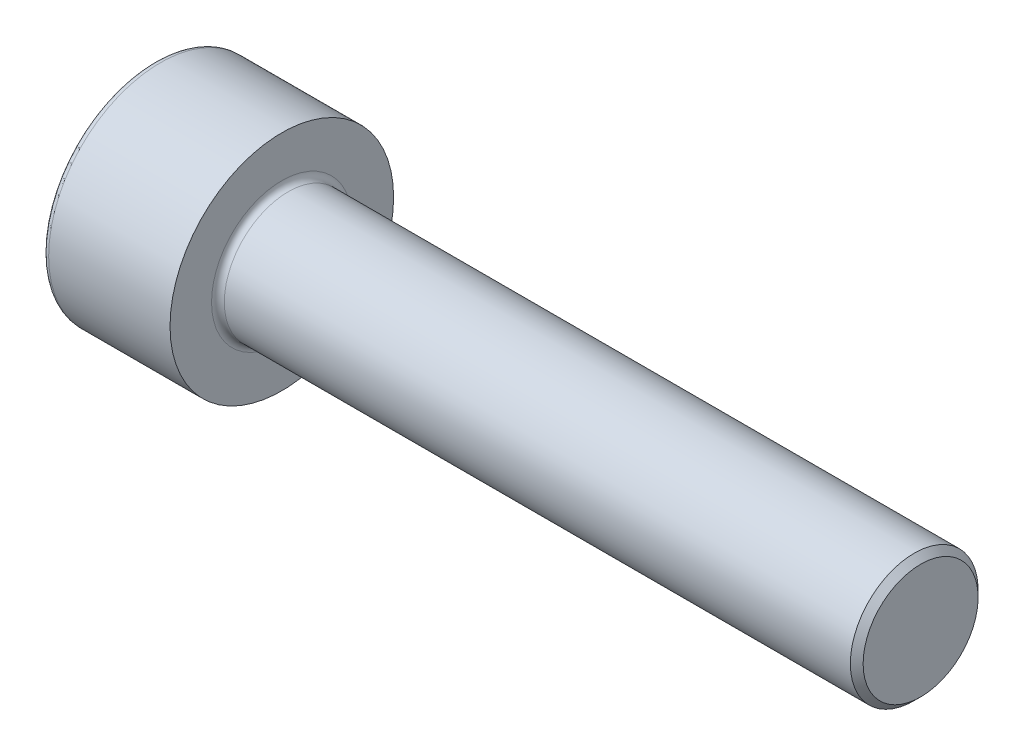
ISO-10303-21;
HEADER;
FILE_DESCRIPTION(('STEP AP214'),'2;1');
FILE_NAME('part.step','',(''),(''),'','','');
FILE_SCHEMA(('AUTOMOTIVE_DESIGN { 1 0 10303 214 1 1 1 1 }'));
ENDSEC;
DATA;
#1=APPLICATION_CONTEXT('core data for automotive mechanical design processes');
#2=APPLICATION_PROTOCOL_DEFINITION('international standard','automotive_design',2000,#1);
#3=PRODUCT_CONTEXT('',#1,'mechanical');
#4=PRODUCT('Part','Part','',(#3));
#5=PRODUCT_RELATED_PRODUCT_CATEGORY('part','',(#4));
#6=PRODUCT_DEFINITION_FORMATION('','',#4);
#7=PRODUCT_DEFINITION_CONTEXT('part definition',#1,'design');
#8=PRODUCT_DEFINITION('design','',#6,#7);
#9=PRODUCT_DEFINITION_SHAPE('','',#8);
#10=(LENGTH_UNIT() NAMED_UNIT(*) SI_UNIT(.MILLI.,.METRE.));
#11=(NAMED_UNIT(*) PLANE_ANGLE_UNIT() SI_UNIT($,.RADIAN.));
#12=(NAMED_UNIT(*) SI_UNIT($,.STERADIAN.) SOLID_ANGLE_UNIT());
#13=UNCERTAINTY_MEASURE_WITH_UNIT(LENGTH_MEASURE(1.E-05),#10,'distance_accuracy_value','');
#14=(GEOMETRIC_REPRESENTATION_CONTEXT(3) GLOBAL_UNCERTAINTY_ASSIGNED_CONTEXT((#13)) GLOBAL_UNIT_ASSIGNED_CONTEXT((#10,
#11,#12)) REPRESENTATION_CONTEXT('',''));
#15=CARTESIAN_POINT('',(0.,0.,0.));
#16=DIRECTION('',(0.,0.,1.));
#17=DIRECTION('',(1.,0.,0.));
#18=AXIS2_PLACEMENT_3D('',#15,#16,#17);
#19=CARTESIAN_POINT('',(0.,0.,0.));
#20=DIRECTION('',(1.,0.,0.));
#21=DIRECTION('',(0.,0.,-0.999999999999998));
#22=AXIS2_PLACEMENT_3D('',#19,#20,#21);
#23=PLANE('',#22);
#24=CARTESIAN_POINT('',(0.,0.,0.));
#25=DIRECTION('',(1.,0.,0.));
#26=DIRECTION('',(0.,0.,-0.999999999999998));
#27=AXIS2_PLACEMENT_3D('',#24,#25,#26);
#28=CIRCLE('',#27,3.3);
#29=CARTESIAN_POINT('',(0.,0.,-3.29999999999999));
#30=VERTEX_POINT('',#29);
#31=EDGE_CURVE('E169',#30,#30,#28,.F.);
#32=ORIENTED_EDGE('',*,*,#31,.T.);
#33=EDGE_LOOP('',(#32));
#34=FACE_BOUND('',#33,.T.);
#35=DIRECTION('',(0.,0.,-0.999999999999998));
#36=VECTOR('',#35,1.);
#37=CARTESIAN_POINT('',(0.,1.50000000000039,0.866025403784887));
#38=LINE('',#37,#36);
#39=CARTESIAN_POINT('',(0.,1.50000000000039,0.866025403784887));
#40=VERTEX_POINT('',#39);
#41=CARTESIAN_POINT('',(0.,1.50000000000061,-0.86602540378411));
#42=VERTEX_POINT('',#41);
#43=EDGE_CURVE('E64',#40,#42,#38,.T.);
#44=ORIENTED_EDGE('',*,*,#43,.F.);
#45=DIRECTION('',(0.,0.866025403784441,-0.500000000000002));
#46=VECTOR('',#45,1.);
#47=CARTESIAN_POINT('',(0.,6.66133814775094E-13,1.73205080756889));
#48=LINE('',#47,#46);
#49=CARTESIAN_POINT('',(0.,6.66133814775094E-13,1.73205080756889));
#50=VERTEX_POINT('',#49);
#51=EDGE_CURVE('E138',#50,#40,#48,.T.);
#52=ORIENTED_EDGE('',*,*,#51,.F.);
#53=DIRECTION('',(0.,0.866025403784438,0.499999999999996));
#54=VECTOR('',#53,1.);
#55=CARTESIAN_POINT('',(0.,-1.50000000000039,0.866025403784942));
#56=LINE('',#55,#54);
#57=CARTESIAN_POINT('',(0.,-1.50000000000039,0.866025403784942));
#58=VERTEX_POINT('',#57);
#59=EDGE_CURVE('E148',#58,#50,#56,.T.);
#60=ORIENTED_EDGE('',*,*,#59,.F.);
#61=DIRECTION('',(0.,0.,0.999999999999998));
#62=VECTOR('',#61,1.);
#63=CARTESIAN_POINT('',(0.,-1.50000000000083,-0.866025403784609));
#64=LINE('',#63,#62);
#65=CARTESIAN_POINT('',(0.,-1.50000000000083,-0.866025403784609));
#66=VERTEX_POINT('',#65);
#67=EDGE_CURVE('E297',#66,#58,#64,.T.);
#68=ORIENTED_EDGE('',*,*,#67,.F.);
#69=DIRECTION('',(0.,-0.866025403784441,0.500000000000002));
#70=VECTOR('',#69,1.);
#71=CARTESIAN_POINT('',(0.,-5.55111512312578E-13,-1.73205080756911));
#72=LINE('',#71,#70);
#73=CARTESIAN_POINT('',(0.,-5.55111512312578E-13,-1.73205080756911));
#74=VERTEX_POINT('',#73);
#75=EDGE_CURVE('E124',#74,#66,#72,.T.);
#76=ORIENTED_EDGE('',*,*,#75,.F.);
#77=DIRECTION('',(0.,-0.866025403784438,-0.499999999999996));
#78=VECTOR('',#77,1.);
#79=CARTESIAN_POINT('',(0.,1.50000000000061,-0.86602540378411));
#80=LINE('',#79,#78);
#81=EDGE_CURVE('E122',#42,#74,#80,.T.);
#82=ORIENTED_EDGE('',*,*,#81,.F.);
#83=EDGE_LOOP('',(#44,#52,#60,#68,#76,#82));
#84=FACE_BOUND('',#83,.T.);
#85=ADVANCED_FACE('F49',(#34,#84),#23,.F.);
#86=CARTESIAN_POINT('',(0.,0.,0.));
#87=DIRECTION('',(-1.,0.,0.));
#88=DIRECTION('',(0.,0.,0.999999999999998));
#89=AXIS2_PLACEMENT_3D('',#86,#87,#88);
#90=CYLINDRICAL_SURFACE('',#89,3.5);
#91=CARTESIAN_POINT('',(0.200000000000006,0.,0.));
#92=DIRECTION('',(1.,0.,0.));
#93=DIRECTION('',(0.,0.,-0.999999999999998));
#94=AXIS2_PLACEMENT_3D('',#91,#92,#93);
#95=CIRCLE('',#94,3.5);
#96=CARTESIAN_POINT('',(0.200000000000009,0.,-3.49999999999999));
#97=VERTEX_POINT('',#96);
#98=EDGE_CURVE('E172',#97,#97,#95,.T.);
#99=ORIENTED_EDGE('',*,*,#98,.T.);
#100=EDGE_LOOP('',(#99));
#101=FACE_BOUND('',#100,.T.);
#102=CARTESIAN_POINT('',(4.,0.,0.));
#103=DIRECTION('',(-1.,0.,0.));
#104=DIRECTION('',(0.,0.,0.999999999999998));
#105=AXIS2_PLACEMENT_3D('',#102,#103,#104);
#106=CIRCLE('',#105,3.5);
#107=CARTESIAN_POINT('',(4.,0.,3.49999999999999));
#108=VERTEX_POINT('',#107);
#109=EDGE_CURVE('E159',#108,#108,#106,.T.);
#110=ORIENTED_EDGE('',*,*,#109,.T.);
#111=EDGE_LOOP('',(#110));
#112=FACE_BOUND('',#111,.T.);
#113=ADVANCED_FACE('F190',(#101,#112),#90,.T.);
#114=CARTESIAN_POINT('',(4.,3.50000000000095,1.11022302462516E-13));
#115=DIRECTION('',(-1.,0.,0.));
#116=DIRECTION('',(0.,0.,0.999999999999998));
#117=AXIS2_PLACEMENT_3D('',#114,#115,#116);
#118=PLANE('',#117);
#119=CARTESIAN_POINT('',(4.,0.,0.));
#120=DIRECTION('',(-1.,0.,0.));
#121=DIRECTION('',(0.,0.,0.999999999999998));
#122=AXIS2_PLACEMENT_3D('',#119,#120,#121);
#123=CIRCLE('',#122,2.2);
#124=CARTESIAN_POINT('',(4.,0.,2.2));
#125=VERTEX_POINT('',#124);
#126=EDGE_CURVE('E163',#125,#125,#123,.T.);
#127=ORIENTED_EDGE('',*,*,#126,.T.);
#128=EDGE_LOOP('',(#127));
#129=FACE_BOUND('',#128,.T.);
#130=ORIENTED_EDGE('',*,*,#109,.F.);
#131=EDGE_LOOP('',(#130));
#132=FACE_BOUND('',#131,.T.);
#133=ADVANCED_FACE('F196',(#129,#132),#118,.F.);
#134=CARTESIAN_POINT('',(0.,0.,0.));
#135=DIRECTION('',(-1.,0.,0.));
#136=DIRECTION('',(0.,0.,0.999999999999998));
#137=AXIS2_PLACEMENT_3D('',#134,#135,#136);
#138=CYLINDRICAL_SURFACE('',#137,2.);
#139=CARTESIAN_POINT('',(23.8,0.,0.));
#140=DIRECTION('',(-1.,0.,0.));
#141=DIRECTION('',(0.,0.,0.999999999999998));
#142=AXIS2_PLACEMENT_3D('',#139,#140,#141);
#143=CIRCLE('',#142,2.);
#144=CARTESIAN_POINT('',(23.8,0.,2.));
#145=VERTEX_POINT('',#144);
#146=EDGE_CURVE('E57',#145,#145,#143,.T.);
#147=ORIENTED_EDGE('',*,*,#146,.T.);
#148=EDGE_LOOP('',(#147));
#149=FACE_BOUND('',#148,.T.);
#150=CARTESIAN_POINT('',(4.20000000000001,0.,0.));
#151=DIRECTION('',(-1.,0.,0.));
#152=DIRECTION('',(0.,0.,0.999999999999998));
#153=AXIS2_PLACEMENT_3D('',#150,#151,#152);
#154=CIRCLE('',#153,2.);
#155=CARTESIAN_POINT('',(4.20000000000001,0.,2.));
#156=VERTEX_POINT('',#155);
#157=EDGE_CURVE('E166',#156,#156,#154,.F.);
#158=ORIENTED_EDGE('',*,*,#157,.T.);
#159=EDGE_LOOP('',(#158));
#160=FACE_BOUND('',#159,.T.);
#161=ADVANCED_FACE('F177',(#149,#160),#138,.T.);
#162=CARTESIAN_POINT('',(24.,2.00000000000022,0.));
#163=DIRECTION('',(-1.,0.,0.));
#164=DIRECTION('',(0.,0.,0.999999999999998));
#165=AXIS2_PLACEMENT_3D('',#162,#163,#164);
#166=PLANE('',#165);
#167=CARTESIAN_POINT('',(24.,0.,0.));
#168=DIRECTION('',(-1.,0.,0.));
#169=DIRECTION('',(0.,0.,0.999999999999998));
#170=AXIS2_PLACEMENT_3D('',#167,#168,#169);
#171=CIRCLE('',#170,1.79999999999999);
#172=CARTESIAN_POINT('',(24.,0.,1.79999999999999));
#173=VERTEX_POINT('',#172);
#174=EDGE_CURVE('E14',#173,#173,#171,.F.);
#175=ORIENTED_EDGE('',*,*,#174,.T.);
#176=EDGE_LOOP('',(#175));
#177=FACE_BOUND('',#176,.T.);
#178=ADVANCED_FACE('F221',(#177),#166,.F.);
#179=CARTESIAN_POINT('',(8.58257569495582,5.55111512312578E-13,1.73205080756933));
#180=DIRECTION('',(0.,0.499999999999997,0.866025403784436));
#181=DIRECTION('',(0.,-0.866025403784441,0.500000000000002));
#182=AXIS2_PLACEMENT_3D('',#179,#180,#181);
#183=PLANE('',#182);
#184=ORIENTED_EDGE('',*,*,#51,.T.);
#185=DIRECTION('',(-1.,0.,0.));
#186=VECTOR('',#185,1.);
#187=CARTESIAN_POINT('',(8.58257569495582,1.50000000000072,0.866025403784942));
#188=LINE('',#187,#186);
#189=CARTESIAN_POINT('',(2.59999999999999,1.50000000000039,0.866025403784887));
#190=VERTEX_POINT('',#189);
#191=EDGE_CURVE('E136',#190,#40,#188,.T.);
#192=ORIENTED_EDGE('',*,*,#191,.F.);
#193=DIRECTION('',(0.,-0.866025403784441,0.500000000000002));
#194=VECTOR('',#193,1.);
#195=CARTESIAN_POINT('',(2.59999999999999,6.66133814775094E-13,1.73205080756889));
#196=LINE('',#195,#194);
#197=CARTESIAN_POINT('',(2.59999999999999,0.750000000000806,1.29903810567694));
#198=VERTEX_POINT('',#197);
#199=EDGE_CURVE('E72',#190,#198,#196,.T.);
#200=ORIENTED_EDGE('',*,*,#199,.T.);
#201=CARTESIAN_POINT('',(2.59999999999999,6.66133814775094E-13,1.73205080756889));
#202=VERTEX_POINT('',#201);
#203=EDGE_CURVE('E269',#198,#202,#196,.T.);
#204=ORIENTED_EDGE('',*,*,#203,.T.);
#205=DIRECTION('',(-1.,0.,0.));
#206=VECTOR('',#205,1.);
#207=CARTESIAN_POINT('',(8.58257569495582,5.55111512312578E-13,1.73205080756933));
#208=LINE('',#207,#206);
#209=EDGE_CURVE('E284',#202,#50,#208,.T.);
#210=ORIENTED_EDGE('',*,*,#209,.T.);
#211=EDGE_LOOP('',(#184,#192,#200,#204,#210));
#212=FACE_BOUND('',#211,.T.);
#213=ADVANCED_FACE('F225',(#212),#183,.F.);
#214=CARTESIAN_POINT('',(8.58257569495582,-1.50000000000061,0.866025403784998));
#215=DIRECTION('',(0.,-0.500000000000004,0.866025403784439));
#216=DIRECTION('',(0.,-0.866025403784439,-0.499999999999996));
#217=AXIS2_PLACEMENT_3D('',#214,#215,#216);
#218=PLANE('',#217);
#219=ORIENTED_EDGE('',*,*,#59,.T.);
#220=ORIENTED_EDGE('',*,*,#209,.F.);
#221=DIRECTION('',(0.,-0.866025403784439,-0.499999999999996));
#222=VECTOR('',#221,1.);
#223=CARTESIAN_POINT('',(2.60000000000002,-1.50000000000039,0.866025403784942));
#224=LINE('',#223,#222);
#225=CARTESIAN_POINT('',(2.60000000000002,-0.750000000000361,1.29903810567644));
#226=VERTEX_POINT('',#225);
#227=EDGE_CURVE('E267',#202,#226,#224,.T.);
#228=ORIENTED_EDGE('',*,*,#227,.T.);
#229=CARTESIAN_POINT('',(2.60000000000002,-1.50000000000039,0.866025403784942));
#230=VERTEX_POINT('',#229);
#231=EDGE_CURVE('E275',#226,#230,#224,.T.);
#232=ORIENTED_EDGE('',*,*,#231,.T.);
#233=DIRECTION('',(-1.,0.,0.));
#234=VECTOR('',#233,1.);
#235=CARTESIAN_POINT('',(8.58257569495582,-1.50000000000061,0.866025403784998));
#236=LINE('',#235,#234);
#237=EDGE_CURVE('E301',#230,#58,#236,.T.);
#238=ORIENTED_EDGE('',*,*,#237,.T.);
#239=EDGE_LOOP('',(#219,#220,#228,#232,#238));
#240=FACE_BOUND('',#239,.T.);
#241=ADVANCED_FACE('F230',(#240),#218,.F.);
#242=CARTESIAN_POINT('',(8.58257569495571,-1.50000000000061,-0.866025403784332));
#243=DIRECTION('',(0.,-1.,0.));
#244=DIRECTION('',(0.,0.,-0.999999999999998));
#245=AXIS2_PLACEMENT_3D('',#242,#243,#244);
#246=PLANE('',#245);
#247=ORIENTED_EDGE('',*,*,#67,.T.);
#248=ORIENTED_EDGE('',*,*,#237,.F.);
#249=DIRECTION('',(0.,0.,-0.999999999999998));
#250=VECTOR('',#249,1.);
#251=CARTESIAN_POINT('',(2.60000000000002,-1.50000000000061,-0.866025403784332));
#252=LINE('',#251,#250);
#253=CARTESIAN_POINT('',(2.60000000000002,-1.50000000000006,0.));
#254=VERTEX_POINT('',#253);
#255=EDGE_CURVE('E278',#230,#254,#252,.T.);
#256=ORIENTED_EDGE('',*,*,#255,.T.);
#257=CARTESIAN_POINT('',(2.60000000000002,-1.50000000000061,-0.866025403784332));
#258=VERTEX_POINT('',#257);
#259=EDGE_CURVE('E304',#254,#258,#252,.T.);
#260=ORIENTED_EDGE('',*,*,#259,.T.);
#261=DIRECTION('',(-1.,0.,0.));
#262=VECTOR('',#261,1.);
#263=CARTESIAN_POINT('',(8.58257569495571,-1.50000000000061,-0.866025403784332));
#264=LINE('',#263,#262);
#265=EDGE_CURVE('E146',#258,#66,#264,.T.);
#266=ORIENTED_EDGE('',*,*,#265,.T.);
#267=EDGE_LOOP('',(#247,#248,#256,#260,#266));
#268=FACE_BOUND('',#267,.T.);
#269=ADVANCED_FACE('F239',(#268),#246,.F.);
#270=CARTESIAN_POINT('',(8.58257569495582,-7.7715611723761E-13,-1.7320508075685));
#271=DIRECTION('',(0.,-0.499999999999997,-0.866025403784436));
#272=DIRECTION('',(0.,0.866025403784441,-0.500000000000002));
#273=AXIS2_PLACEMENT_3D('',#270,#271,#272);
#274=PLANE('',#273);
#275=ORIENTED_EDGE('',*,*,#75,.T.);
#276=ORIENTED_EDGE('',*,*,#265,.F.);
#277=DIRECTION('',(0.,0.866025403784441,-0.500000000000002));
#278=VECTOR('',#277,1.);
#279=CARTESIAN_POINT('',(2.60000000000002,-5.55111512312578E-13,-1.732050807569));
#280=LINE('',#279,#278);
#281=CARTESIAN_POINT('',(2.59999999999999,-0.750000000000473,-1.29903810567633));
#282=VERTEX_POINT('',#281);
#283=EDGE_CURVE('E307',#258,#282,#280,.T.);
#284=ORIENTED_EDGE('',*,*,#283,.T.);
#285=CARTESIAN_POINT('',(2.60000000000002,-5.55111512312578E-13,-1.732050807569));
#286=VERTEX_POINT('',#285);
#287=EDGE_CURVE('E309',#282,#286,#280,.T.);
#288=ORIENTED_EDGE('',*,*,#287,.T.);
#289=DIRECTION('',(-1.,0.,0.));
#290=VECTOR('',#289,1.);
#291=CARTESIAN_POINT('',(8.58257569495582,-7.7715611723761E-13,-1.7320508075685));
#292=LINE('',#291,#290);
#293=EDGE_CURVE('E144',#286,#74,#292,.T.);
#294=ORIENTED_EDGE('',*,*,#293,.T.);
#295=EDGE_LOOP('',(#275,#276,#284,#288,#294));
#296=FACE_BOUND('',#295,.T.);
#297=ADVANCED_FACE('F236',(#296),#274,.F.);
#298=CARTESIAN_POINT('',(8.58257569495582,1.50000000000061,-0.86602540378411));
#299=DIRECTION('',(0.,0.500000000000004,-0.866025403784439));
#300=DIRECTION('',(0.,0.866025403784439,0.499999999999996));
#301=AXIS2_PLACEMENT_3D('',#298,#299,#300);
#302=PLANE('',#301);
#303=ORIENTED_EDGE('',*,*,#81,.T.);
#304=ORIENTED_EDGE('',*,*,#293,.F.);
#305=DIRECTION('',(0.,0.866025403784439,0.499999999999996));
#306=VECTOR('',#305,1.);
#307=CARTESIAN_POINT('',(2.59999999999999,1.50000000000061,-0.86602540378411));
#308=LINE('',#307,#306);
#309=CARTESIAN_POINT('',(2.60000000000002,0.749999999999362,-1.29903810567639));
#310=VERTEX_POINT('',#309);
#311=EDGE_CURVE('E311',#286,#310,#308,.T.);
#312=ORIENTED_EDGE('',*,*,#311,.T.);
#313=CARTESIAN_POINT('',(2.59999999999999,1.50000000000061,-0.86602540378411));
#314=VERTEX_POINT('',#313);
#315=EDGE_CURVE('E143',#310,#314,#308,.T.);
#316=ORIENTED_EDGE('',*,*,#315,.T.);
#317=DIRECTION('',(-1.,0.,0.));
#318=VECTOR('',#317,1.);
#319=CARTESIAN_POINT('',(8.58257569495582,1.50000000000061,-0.86602540378411));
#320=LINE('',#319,#318);
#321=EDGE_CURVE('E134',#314,#42,#320,.T.);
#322=ORIENTED_EDGE('',*,*,#321,.T.);
#323=EDGE_LOOP('',(#303,#304,#312,#316,#322));
#324=FACE_BOUND('',#323,.T.);
#325=ADVANCED_FACE('F140',(#324),#302,.F.);
#326=CARTESIAN_POINT('',(8.58257569495582,1.50000000000072,0.866025403784942));
#327=DIRECTION('',(0.,1.,0.));
#328=DIRECTION('',(0.,0.,0.999999999999999));
#329=AXIS2_PLACEMENT_3D('',#326,#327,#328);
#330=PLANE('',#329);
#331=ORIENTED_EDGE('',*,*,#43,.T.);
#332=ORIENTED_EDGE('',*,*,#321,.F.);
#333=DIRECTION('',(0.,0.,0.999999999999999));
#334=VECTOR('',#333,1.);
#335=CARTESIAN_POINT('',(2.59999999999999,1.50000000000039,0.866025403784887));
#336=LINE('',#335,#334);
#337=CARTESIAN_POINT('',(2.59999999999999,1.50000000000061,1.11022302462516E-13));
#338=VERTEX_POINT('',#337);
#339=EDGE_CURVE('E152',#314,#338,#336,.T.);
#340=ORIENTED_EDGE('',*,*,#339,.T.);
#341=EDGE_CURVE('E155',#338,#190,#336,.T.);
#342=ORIENTED_EDGE('',*,*,#341,.T.);
#343=ORIENTED_EDGE('',*,*,#191,.T.);
#344=EDGE_LOOP('',(#331,#332,#340,#342,#343));
#345=FACE_BOUND('',#344,.T.);
#346=ADVANCED_FACE('F132',(#345),#330,.F.);
#347=CARTESIAN_POINT('',(2.59999999999999,3.50000000000084,1.11022302462516E-13));
#348=DIRECTION('',(-1.,0.,0.));
#349=DIRECTION('',(0.,0.,0.999999999999998));
#350=AXIS2_PLACEMENT_3D('',#347,#348,#349);
#351=PLANE('',#350);
#352=CARTESIAN_POINT('',(2.60000000000002,2.22044604925031E-13,-1.11022302462516E-13));
#353=DIRECTION('',(-1.,0.,0.));
#354=DIRECTION('',(0.,0.,0.999999999999998));
#355=AXIS2_PLACEMENT_3D('',#352,#353,#354);
#356=CIRCLE('',#355,1.5);
#357=EDGE_CURVE('E273',#254,#226,#356,.T.);
#358=ORIENTED_EDGE('',*,*,#357,.F.);
#359=ORIENTED_EDGE('',*,*,#255,.F.);
#360=ORIENTED_EDGE('',*,*,#231,.F.);
#361=EDGE_LOOP('',(#358,#359,#360));
#362=FACE_BOUND('',#361,.T.);
#363=ADVANCED_FACE('F233',(#362),#351,.T.);
#364=EDGE_CURVE('E287',#282,#254,#356,.T.);
#365=ORIENTED_EDGE('',*,*,#364,.F.);
#366=ORIENTED_EDGE('',*,*,#283,.F.);
#367=ORIENTED_EDGE('',*,*,#259,.F.);
#368=EDGE_LOOP('',(#365,#366,#367));
#369=FACE_BOUND('',#368,.T.);
#370=ADVANCED_FACE('F248',(#369),#351,.T.);
#371=EDGE_CURVE('E288',#310,#282,#356,.T.);
#372=ORIENTED_EDGE('',*,*,#371,.F.);
#373=ORIENTED_EDGE('',*,*,#311,.F.);
#374=ORIENTED_EDGE('',*,*,#287,.F.);
#375=EDGE_LOOP('',(#372,#373,#374));
#376=FACE_BOUND('',#375,.T.);
#377=ADVANCED_FACE('F253',(#376),#351,.T.);
#378=EDGE_CURVE('E160',#338,#310,#356,.T.);
#379=ORIENTED_EDGE('',*,*,#378,.F.);
#380=ORIENTED_EDGE('',*,*,#339,.F.);
#381=ORIENTED_EDGE('',*,*,#315,.F.);
#382=EDGE_LOOP('',(#379,#380,#381));
#383=FACE_BOUND('',#382,.T.);
#384=ADVANCED_FACE('F261',(#383),#351,.T.);
#385=EDGE_CURVE('E156',#198,#338,#356,.T.);
#386=ORIENTED_EDGE('',*,*,#385,.F.);
#387=ORIENTED_EDGE('',*,*,#199,.F.);
#388=ORIENTED_EDGE('',*,*,#341,.F.);
#389=EDGE_LOOP('',(#386,#387,#388));
#390=FACE_BOUND('',#389,.T.);
#391=ADVANCED_FACE('F256',(#390),#351,.T.);
#392=EDGE_CURVE('E154',#226,#198,#356,.T.);
#393=ORIENTED_EDGE('',*,*,#392,.F.);
#394=ORIENTED_EDGE('',*,*,#227,.F.);
#395=ORIENTED_EDGE('',*,*,#203,.F.);
#396=EDGE_LOOP('',(#393,#394,#395));
#397=FACE_BOUND('',#396,.T.);
#398=ADVANCED_FACE('F207',(#397),#351,.T.);
#399=CARTESIAN_POINT('',(2.60000000000002,2.22044604925031E-13,-1.11022302462516E-13));
#400=DIRECTION('',(-1.,0.,0.));
#401=DIRECTION('',(0.,0.,0.999999999999998));
#402=AXIS2_PLACEMENT_3D('',#399,#400,#401);
#403=CONICAL_SURFACE('',#402,1.5,1.02974425867665);
#404=CARTESIAN_POINT('',(3.50129092854135,0.,0.));
#405=VERTEX_POINT('',#404);
#406=VERTEX_LOOP('',#405);
#407=FACE_BOUND('',#406,.T.);
#408=ORIENTED_EDGE('',*,*,#385,.T.);
#409=ORIENTED_EDGE('',*,*,#378,.T.);
#410=ORIENTED_EDGE('',*,*,#371,.T.);
#411=ORIENTED_EDGE('',*,*,#364,.T.);
#412=ORIENTED_EDGE('',*,*,#357,.T.);
#413=ORIENTED_EDGE('',*,*,#392,.T.);
#414=EDGE_LOOP('',(#408,#409,#410,#411,#412,#413));
#415=FACE_BOUND('',#414,.T.);
#416=ADVANCED_FACE('F202',(#407,#415),#403,.F.);
#417=CARTESIAN_POINT('',(4.20000000000001,0.,0.));
#418=DIRECTION('',(-1.,0.,0.));
#419=DIRECTION('',(0.,0.,0.999999999999998));
#420=AXIS2_PLACEMENT_3D('',#417,#418,#419);
#421=TOROIDAL_SURFACE('',#420,2.2,0.2);
#422=ORIENTED_EDGE('',*,*,#157,.F.);
#423=EDGE_LOOP('',(#422));
#424=FACE_BOUND('',#423,.T.);
#425=ORIENTED_EDGE('',*,*,#126,.F.);
#426=EDGE_LOOP('',(#425));
#427=FACE_BOUND('',#426,.T.);
#428=ADVANCED_FACE('F186',(#424,#427),#421,.F.);
#429=CARTESIAN_POINT('',(0.200000000000006,0.,0.));
#430=DIRECTION('',(1.,0.,0.));
#431=DIRECTION('',(0.,0.,-0.999999999999998));
#432=AXIS2_PLACEMENT_3D('',#429,#430,#431);
#433=TOROIDAL_SURFACE('',#432,3.3,0.2);
#434=ORIENTED_EDGE('',*,*,#98,.F.);
#435=EDGE_LOOP('',(#434));
#436=FACE_BOUND('',#435,.T.);
#437=ORIENTED_EDGE('',*,*,#31,.F.);
#438=EDGE_LOOP('',(#437));
#439=FACE_BOUND('',#438,.T.);
#440=ADVANCED_FACE('F181',(#436,#439),#433,.T.);
#441=CARTESIAN_POINT('',(23.8,0.,0.));
#442=DIRECTION('',(-1.,0.,0.));
#443=DIRECTION('',(0.,0.,0.999999999999998));
#444=AXIS2_PLACEMENT_3D('',#441,#442,#443);
#445=CONICAL_SURFACE('',#444,2.,0.785398163397461);
#446=ORIENTED_EDGE('',*,*,#174,.F.);
#447=EDGE_LOOP('',(#446));
#448=FACE_BOUND('',#447,.T.);
#449=ORIENTED_EDGE('',*,*,#146,.F.);
#450=EDGE_LOOP('',(#449));
#451=FACE_BOUND('',#450,.T.);
#452=ADVANCED_FACE('F51',(#448,#451),#445,.T.);
#453=CLOSED_SHELL('',(#85,#113,#133,#161,#178,#213,#241,#269,#297,#325,#346,#363,#370,#377,#384,
#391,#398,#416,#428,#440,#452));
#454=MANIFOLD_SOLID_BREP('B2',#453);
#455=ADVANCED_BREP_SHAPE_REPRESENTATION('',(#18,#454),#14);
#456=SHAPE_DEFINITION_REPRESENTATION(#9,#455);
ENDSEC;
END-ISO-10303-21;
